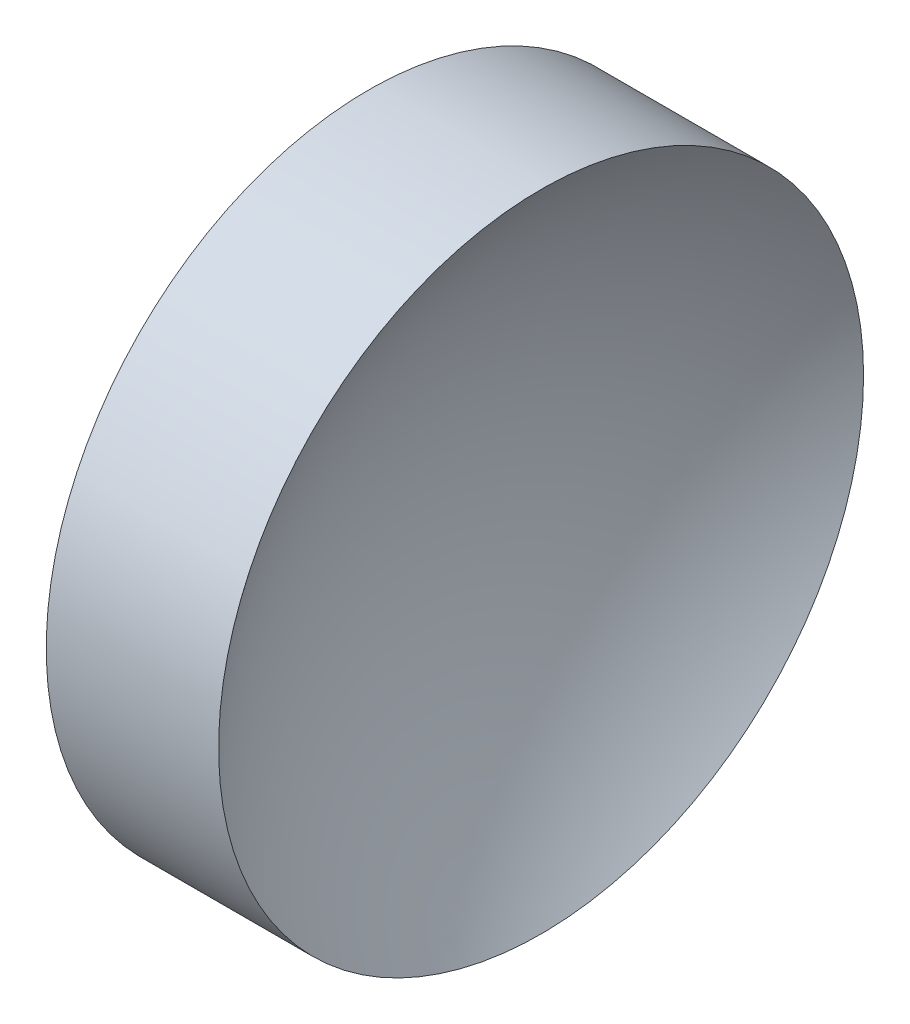
ISO-10303-21;
HEADER;
FILE_DESCRIPTION(('STEP AP214'),'2;1');
FILE_NAME('part.step','',(''),(''),'','','');
FILE_SCHEMA(('AUTOMOTIVE_DESIGN { 1 0 10303 214 1 1 1 1 }'));
ENDSEC;
DATA;
#1=APPLICATION_CONTEXT('core data for automotive mechanical design processes');
#2=APPLICATION_PROTOCOL_DEFINITION('international standard','automotive_design',2000,#1);
#3=PRODUCT_CONTEXT('',#1,'mechanical');
#4=PRODUCT('Part','Part','',(#3));
#5=PRODUCT_RELATED_PRODUCT_CATEGORY('part','',(#4));
#6=PRODUCT_DEFINITION_FORMATION('','',#4);
#7=PRODUCT_DEFINITION_CONTEXT('part definition',#1,'design');
#8=PRODUCT_DEFINITION('design','',#6,#7);
#9=PRODUCT_DEFINITION_SHAPE('','',#8);
#10=(LENGTH_UNIT() NAMED_UNIT(*) SI_UNIT(.MILLI.,.METRE.));
#11=(NAMED_UNIT(*) PLANE_ANGLE_UNIT() SI_UNIT($,.RADIAN.));
#12=(NAMED_UNIT(*) SI_UNIT($,.STERADIAN.) SOLID_ANGLE_UNIT());
#13=UNCERTAINTY_MEASURE_WITH_UNIT(LENGTH_MEASURE(1.E-05),#10,'distance_accuracy_value','');
#14=(GEOMETRIC_REPRESENTATION_CONTEXT(3) GLOBAL_UNCERTAINTY_ASSIGNED_CONTEXT((#13)) GLOBAL_UNIT_ASSIGNED_CONTEXT((#10,
#11,#12)) REPRESENTATION_CONTEXT('',''));
#15=CARTESIAN_POINT('',(0.,0.,0.));
#16=DIRECTION('',(0.,0.,1.));
#17=DIRECTION('',(1.,0.,0.));
#18=AXIS2_PLACEMENT_3D('',#15,#16,#17);
#19=CARTESIAN_POINT('',(58.7291800526974,26.089041149195,-0.00191846830218875));
#20=DIRECTION('',(0.,-1.,0.));
#21=DIRECTION('',(0.,0.,-1.));
#22=AXIS2_PLACEMENT_3D('',#19,#20,#21);
#23=CIRCLE('',#22,12.91);
#24=TRIMMED_CURVE('',#23,(PARAMETER_VALUE(-1.57094493007214)),
(PARAMETER_VALUE(1.57094493007214)),.T.,.PARAMETER.);
#25=CARTESIAN_POINT('',(58.7291800526974,26.089041149195,0.));
#26=DIRECTION('',(1.,0.,0.));
#27=AXIS1_PLACEMENT('',#25,#26);
#28=SURFACE_OF_REVOLUTION('',#24,#27);
#29=CARTESIAN_POINT('',(48.5951388147551,26.089041149195,0.));
#30=DIRECTION('',(1.,0.,0.));
#31=DIRECTION('',(0.,0.,-1.));
#32=AXIS2_PLACEMENT_3D('',#29,#30,#31);
#33=CIRCLE('',#32,8.);
#34=CARTESIAN_POINT('',(48.5951388147551,26.089041149195,-8.));
#35=VERTEX_POINT('',#34);
#36=EDGE_CURVE('E11',#35,#35,#33,.T.);
#37=ORIENTED_EDGE('',*,*,#36,.T.);
#38=EDGE_LOOP('',(#37));
#39=FACE_BOUND('',#38,.T.);
#40=CARTESIAN_POINT('',(45.8191801952427,26.089041149195,0.));
#41=VERTEX_POINT('',#40);
#42=VERTEX_LOOP('',#41);
#43=FACE_BOUND('',#42,.T.);
#44=ADVANCED_FACE('F37',(#39,#43),#28,.F.);
#45=CARTESIAN_POINT('',(45.8191801952427,26.089041149195,0.));
#46=DIRECTION('',(1.,0.,0.));
#47=DIRECTION('',(0.,0.,-1.));
#48=AXIS2_PLACEMENT_3D('',#45,#46,#47);
#49=CYLINDRICAL_SURFACE('',#48,8.);
#50=CARTESIAN_POINT('',(44.3191526931544,26.089041149195,0.));
#51=DIRECTION('',(1.,0.,0.));
#52=DIRECTION('',(0.,0.,-1.));
#53=AXIS2_PLACEMENT_3D('',#50,#51,#52);
#54=CIRCLE('',#53,8.);
#55=CARTESIAN_POINT('',(44.3191526931544,26.089041149195,-8.));
#56=VERTEX_POINT('',#55);
#57=EDGE_CURVE('E43',#56,#56,#54,.T.);
#58=ORIENTED_EDGE('',*,*,#57,.T.);
#59=EDGE_LOOP('',(#58));
#60=FACE_BOUND('',#59,.T.);
#61=ORIENTED_EDGE('',*,*,#36,.F.);
#62=EDGE_LOOP('',(#61));
#63=FACE_BOUND('',#62,.T.);
#64=ADVANCED_FACE('F47',(#60,#63),#49,.T.);
#65=CARTESIAN_POINT('',(44.3191526931544,26.089041149195,0.));
#66=DIRECTION('',(-1.,0.,0.));
#67=DIRECTION('',(0.,0.,1.));
#68=AXIS2_PLACEMENT_3D('',#65,#66,#67);
#69=PLANE('',#68);
#70=ORIENTED_EDGE('',*,*,#57,.F.);
#71=EDGE_LOOP('',(#70));
#72=FACE_BOUND('',#71,.T.);
#73=ADVANCED_FACE('F52',(#72),#69,.T.);
#74=CLOSED_SHELL('',(#44,#64,#73));
#75=MANIFOLD_SOLID_BREP('B2',#74);
#76=ADVANCED_BREP_SHAPE_REPRESENTATION('',(#18,#75),#14);
#77=SHAPE_DEFINITION_REPRESENTATION(#9,#76);
ENDSEC;
END-ISO-10303-21;
